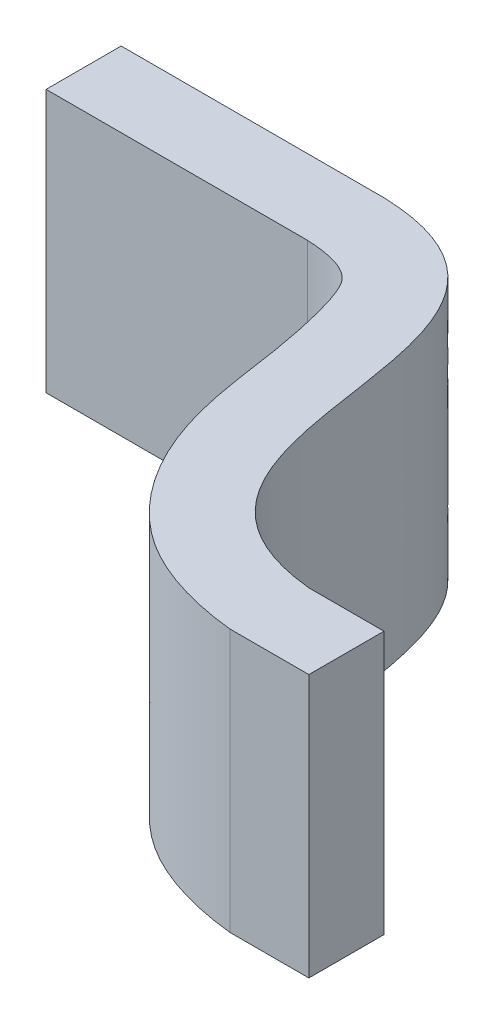
ISO-10303-21;
HEADER;
FILE_DESCRIPTION(('STEP AP214'),'2;1');
FILE_NAME('part.step','',(''),(''),'','','');
FILE_SCHEMA(('AUTOMOTIVE_DESIGN { 1 0 10303 214 1 1 1 1 }'));
ENDSEC;
DATA;
#1=APPLICATION_CONTEXT('core data for automotive mechanical design processes');
#2=APPLICATION_PROTOCOL_DEFINITION('international standard','automotive_design',2000,#1);
#3=PRODUCT_CONTEXT('',#1,'mechanical');
#4=PRODUCT('Part','Part','',(#3));
#5=PRODUCT_RELATED_PRODUCT_CATEGORY('part','',(#4));
#6=PRODUCT_DEFINITION_FORMATION('','',#4);
#7=PRODUCT_DEFINITION_CONTEXT('part definition',#1,'design');
#8=PRODUCT_DEFINITION('design','',#6,#7);
#9=PRODUCT_DEFINITION_SHAPE('','',#8);
#10=(LENGTH_UNIT() NAMED_UNIT(*) SI_UNIT(.MILLI.,.METRE.));
#11=(NAMED_UNIT(*) PLANE_ANGLE_UNIT() SI_UNIT($,.RADIAN.));
#12=(NAMED_UNIT(*) SI_UNIT($,.STERADIAN.) SOLID_ANGLE_UNIT());
#13=UNCERTAINTY_MEASURE_WITH_UNIT(LENGTH_MEASURE(1.E-05),#10,'distance_accuracy_value','');
#14=(GEOMETRIC_REPRESENTATION_CONTEXT(3) GLOBAL_UNCERTAINTY_ASSIGNED_CONTEXT((#13)) GLOBAL_UNIT_ASSIGNED_CONTEXT((#10,
#11,#12)) REPRESENTATION_CONTEXT('',''));
#15=CARTESIAN_POINT('',(0.,0.,0.));
#16=DIRECTION('',(0.,0.,1.));
#17=DIRECTION('',(1.,0.,0.));
#18=AXIS2_PLACEMENT_3D('',#15,#16,#17);
#19=CARTESIAN_POINT('',(0.381062000989914,0.523123965857835,1.2000000284124));
#20=DIRECTION('',(0.,-1.,-4.37113882867379E-08));
#21=DIRECTION('',(1.,0.,0.));
#22=AXIS2_PLACEMENT_3D('',#19,#20,#21);
#23=PLANE('',#22);
#24=CARTESIAN_POINT('',(-6.65393799901009,0.523123974600112,1.0000000284124));
#25=CARTESIAN_POINT('',(-6.67603378247592,0.523123974695338,0.997821538224357));
#26=CARTESIAN_POINT('',(-6.69814608533159,0.523123974839427,0.994525167165359));
#27=CARTESIAN_POINT('',(-6.74196000230599,0.523123975256913,0.984974174651607));
#28=CARTESIAN_POINT('',(-6.76365439120462,0.523123975531721,0.978687308291627));
#29=CARTESIAN_POINT('',(-6.80109928914061,0.523123976164227,0.964217236749239));
#30=CARTESIAN_POINT('',(-6.81711598043367,0.523123976490879,0.956744332526842));
#31=CARTESIAN_POINT('',(-6.84771104371223,0.523123977249195,0.939396085829372));
#32=CARTESIAN_POINT('',(-6.86229582381613,0.523123977680359,0.929532203397507));
#33=CARTESIAN_POINT('',(-6.88913715455262,0.523123978627769,0.907857995547797));
#34=CARTESIAN_POINT('',(-6.90145549336788,0.523123979140667,0.896124255535489));
#35=CARTESIAN_POINT('',(-6.92410333203055,0.523123980245379,0.870851377040501));
#36=CARTESIAN_POINT('',(-6.93442941955475,0.523123980837327,0.857309207032078));
#37=CARTESIAN_POINT('',(-6.96672356560466,0.523123982984108,0.808196568837444));
#38=CARTESIAN_POINT('',(-6.98364579428103,0.523123984681639,0.769361583704007));
#39=CARTESIAN_POINT('',(-7.00637915120374,0.523123987710567,0.700067795532776));
#40=CARTESIAN_POINT('',(-7.01393277364121,0.523123989022947,0.670044046614717));
#41=CARTESIAN_POINT('',(-7.02681062279047,0.523123991671226,0.609458466123205));
#42=CARTESIAN_POINT('',(-7.03213106678493,0.523123993007162,0.57889581220654));
#43=CARTESIAN_POINT('',(-7.04523612787774,0.523123996586,0.497021526470975));
#44=CARTESIAN_POINT('',(-7.0522656284455,0.523123998833501,0.445604703624302));
#45=CARTESIAN_POINT('',(-7.06583829430569,0.523124002183083,0.368975220682634));
#46=CARTESIAN_POINT('',(-7.0708647695897,0.52312400329558,0.343524254211093));
#47=CARTESIAN_POINT('',(-7.08290131021325,0.523124005498803,0.293120376456016));
#48=CARTESIAN_POINT('',(-7.08990811721131,0.523124006589561,0.2681667185286));
#49=CARTESIAN_POINT('',(-7.10754242158977,0.52312400877063,0.218269668597797));
#50=CARTESIAN_POINT('',(-7.11830963205075,0.523124009858999,0.193370728858566));
#51=CARTESIAN_POINT('',(-7.13814509854049,0.523124011397179,0.15818128887677));
#52=CARTESIAN_POINT('',(-7.14534233177561,0.523124011892748,0.146843995173803));
#53=CARTESIAN_POINT('',(-7.16105988122924,0.523124012841695,0.125134581067312));
#54=CARTESIAN_POINT('',(-7.16957893209141,0.523124013295114,0.114761552617267));
#55=CARTESIAN_POINT('',(-7.19091439754605,0.523124014285785,0.0920976354280375));
#56=CARTESIAN_POINT('',(-7.20423043199209,0.523124014802873,0.0802680737363762));
#57=CARTESIAN_POINT('',(-7.23280529274656,0.523124015723078,0.0592162571948251));
#58=CARTESIAN_POINT('',(-7.24806736713441,0.523124016126,0.0499984463761804));
#59=CARTESIAN_POINT('',(-7.28055680499388,0.523124016830915,0.0338718636663028));
#60=CARTESIAN_POINT('',(-7.29784019259106,0.523124017127877,0.0270781840761314));
#61=CARTESIAN_POINT('',(-7.33320890349723,0.523124017612247,0.0159971017986522));
#62=CARTESIAN_POINT('',(-7.35129600434054,0.523124017799397,0.0117155856600662));
#63=CARTESIAN_POINT('',(-7.383534227059,0.523124018050521,0.00597054024637853));
#64=CARTESIAN_POINT('',(-7.39761496113673,0.523124018133079,0.00408185602134198));
#65=CARTESIAN_POINT('',(-7.42577624030721,0.523124018253328,0.00133086562621749));
#66=CARTESIAN_POINT('',(-7.43985605615936,0.523124018291339,0.000461264208410071));
#67=CARTESIAN_POINT('',(-7.45393799901012,0.5231240183115,2.84124012060042E-08));
#68=B_SPLINE_CURVE_WITH_KNOTS('',3,(#24,#25,#26,#27,#28,#29,#30,#31,#32,#33,#34,#35,#36,#37,#38,
#39,#40,#41,#42,#43,#44,#45,#46,#47,#48,#49,#50,#51,#52,#53,#54,#55,#56,#57,#58,#59,#60,#61,#62,
#63,#64,#65,#66,#67),.UNSPECIFIED.,.F.,.F.,(4,2,2,2,2,2,2,2,2,2,2,2,2,2,2,2,2,2,2,2,2,4),(0.,
0.0667821137090824,0.134301214684021,0.187128508823984,0.239707439757734,0.290518731452926,
0.341416294675052,0.466712259088967,0.559563019654504,0.652570428897917,0.808245450373591,
0.886023921415191,0.963675157190782,1.0445878496654,1.08478909463836,1.12495209032637,
1.17807587168456,1.23128951042009,1.2867700351769,1.34238004906254,1.38496468867344,
1.42724258099922),.UNSPECIFIED.);
#69=CARTESIAN_POINT('',(-6.65393799901009,0.523123974600112,1.0000000284124));
#70=VERTEX_POINT('',#69);
#71=CARTESIAN_POINT('',(-7.45393799901009,0.523124018311501,2.84124023863797E-08));
#72=VERTEX_POINT('',#71);
#73=EDGE_CURVE('E11',#70,#72,#68,.T.);
#74=ORIENTED_EDGE('',*,*,#73,.F.);
#75=DIRECTION('',(-1.,0.,0.));
#76=VECTOR('',#75,1.);
#77=CARTESIAN_POINT('',(-6.45393799901009,0.523123974600112,1.0000000284124));
#78=LINE('',#77,#76);
#79=CARTESIAN_POINT('',(-6.45393799901009,0.523123974600112,1.0000000284124));
#80=VERTEX_POINT('',#79);
#81=EDGE_CURVE('E179',#80,#70,#78,.T.);
#82=ORIENTED_EDGE('',*,*,#81,.F.);
#83=DIRECTION('',(0.,4.37113883977602E-08,-0.999999999999999));
#84=VECTOR('',#83,1.);
#85=CARTESIAN_POINT('',(-6.45393799901009,0.523123965857835,1.2000000284124));
#86=LINE('',#85,#84);
#87=CARTESIAN_POINT('',(-6.45393799901009,0.523123965857835,1.2000000284124));
#88=VERTEX_POINT('',#87);
#89=EDGE_CURVE('E155',#88,#80,#86,.T.);
#90=ORIENTED_EDGE('',*,*,#89,.F.);
#91=DIRECTION('',(-1.,0.,0.));
#92=VECTOR('',#91,1.);
#93=CARTESIAN_POINT('',(-6.45393799901009,0.523123965857834,1.2000000284124));
#94=LINE('',#93,#92);
#95=CARTESIAN_POINT('',(-6.66373717585809,0.523123965857835,1.2000000284124));
#96=VERTEX_POINT('',#95);
#97=EDGE_CURVE('E148',#88,#96,#94,.T.);
#98=ORIENTED_EDGE('',*,*,#97,.T.);
#99=CARTESIAN_POINT('',(-6.66373717585809,0.523123965857835,1.2000000284124));
#100=CARTESIAN_POINT('',(-6.68237056257263,0.523123965938345,1.19815817509081));
#101=CARTESIAN_POINT('',(-6.70094738722954,0.523123966045734,1.19570139866285));
#102=CARTESIAN_POINT('',(-6.7379246105478,0.523123966316937,1.18949699907566));
#103=CARTESIAN_POINT('',(-6.75632454194431,0.523123966480872,1.1857466015809));
#104=CARTESIAN_POINT('',(-6.7929675339705,0.523123966869247,1.17686162524785));
#105=CARTESIAN_POINT('',(-6.81120769181061,0.523123967094217,1.17171489105383));
#106=CARTESIAN_POINT('',(-6.84718412122,0.523123967609347,1.15993009834338));
#107=CARTESIAN_POINT('',(-6.86492077676558,0.523123967899455,1.15329321263317));
#108=CARTESIAN_POINT('',(-6.90550702441668,0.523123968662994,1.13582549945528));
#109=CARTESIAN_POINT('',(-6.92808530032362,0.52312396916529,1.12433429434549));
#110=CARTESIAN_POINT('',(-6.97098069443299,0.523123970321421,1.09788507421921));
#111=CARTESIAN_POINT('',(-6.99130790145501,0.523123970974536,1.082943537511));
#112=CARTESIAN_POINT('',(-7.0279727762332,0.523123972347729,1.05152854045932));
#113=CARTESIAN_POINT('',(-7.04449924398274,0.523123973058332,1.03527184444206));
#114=CARTESIAN_POINT('',(-7.07543365798622,0.523123974565515,1.00079152577337));
#115=CARTESIAN_POINT('',(-7.08983601944683,0.523123975362312,0.982562928971803));
#116=CARTESIAN_POINT('',(-7.11809776879426,0.523123977121817,0.942310147448806));
#117=CARTESIAN_POINT('',(-7.13168204827002,0.523123978092944,0.920093360969633));
#118=CARTESIAN_POINT('',(-7.15606790009834,0.523123980097733,0.874229145825883));
#119=CARTESIAN_POINT('',(-7.16687319447414,0.523123981131308,0.850583683658809));
#120=CARTESIAN_POINT('',(-7.18657911699553,0.523123983331501,0.800249155192401));
#121=CARTESIAN_POINT('',(-7.19524763842126,0.523123984502043,0.773470263913924));
#122=CARTESIAN_POINT('',(-7.20996785968964,0.523123986874402,0.719197008038475));
#123=CARTESIAN_POINT('',(-7.21601637646933,0.523123988076255,0.691701815934891));
#124=CARTESIAN_POINT('',(-7.22445706680594,0.523123990042534,0.646718611183905));
#125=CARTESIAN_POINT('',(-7.22737168105378,0.523123990802987,0.629321471969463));
#126=CARTESIAN_POINT('',(-7.23282112861414,0.523123992326609,0.594465063705472));
#127=CARTESIAN_POINT('',(-7.23535587567411,0.523123993089778,0.577005781464265));
#128=CARTESIAN_POINT('',(-7.24044379035748,0.523123994615872,0.542092834268316));
#129=CARTESIAN_POINT('',(-7.24299695433449,0.523123995378796,0.524639168879595));
#130=CARTESIAN_POINT('',(-7.24854024165721,0.523123996901418,0.489805623245772));
#131=CARTESIAN_POINT('',(-7.25153024685593,0.523123997661117,0.472425724353722));
#132=CARTESIAN_POINT('',(-7.25940543221582,0.523123999514865,0.430016914878113));
#133=CARTESIAN_POINT('',(-7.26454124775707,0.523124000606984,0.405032186661608));
#134=CARTESIAN_POINT('',(-7.27335782095331,0.523124002233889,0.367812909831137));
#135=CARTESIAN_POINT('',(-7.27648289514104,0.523124002774419,0.355446989187105));
#136=CARTESIAN_POINT('',(-7.2832453862984,0.523124003849237,0.330858098256283));
#137=CARTESIAN_POINT('',(-7.28688251537886,0.523124004383529,0.31863505179595));
#138=CARTESIAN_POINT('',(-7.29335647517369,0.523124005225471,0.299373396061493));
#139=CARTESIAN_POINT('',(-7.29591902475202,0.523124005537099,0.292243982290243));
#140=CARTESIAN_POINT('',(-7.30149713681058,0.523124006152235,0.278171894198806));
#141=CARTESIAN_POINT('',(-7.30451201316556,0.523124006455754,0.27122895550911));
#142=CARTESIAN_POINT('',(-7.31077994191444,0.523124006990216,0.258999943257011));
#143=CARTESIAN_POINT('',(-7.31388605246379,0.523124007224206,0.253644766573164));
#144=CARTESIAN_POINT('',(-7.32081621454635,0.523124007632222,0.244316025576675));
#145=CARTESIAN_POINT('',(-7.32451240161513,0.523124007810065,0.240254004796937));
#146=CARTESIAN_POINT('',(-7.33396137139944,0.523124008166512,0.232075994627863));
#147=CARTESIAN_POINT('',(-7.33999881820825,0.523124008329575,0.228304080400057));
#148=CARTESIAN_POINT('',(-7.34921547868647,0.523124008558503,0.223113120130131));
#149=CARTESIAN_POINT('',(-7.35230200427145,0.523124008631944,0.221466188737755));
#150=CARTESIAN_POINT('',(-7.35859228869369,0.523124008763141,0.218417400174968));
#151=CARTESIAN_POINT('',(-7.36179572518167,0.523124008820938,0.21701492284427));
#152=CARTESIAN_POINT('',(-7.37091592035366,0.523124008970907,0.213465070828702));
#153=CARTESIAN_POINT('',(-7.37694933123149,0.523124009053497,0.211621727693836));
#154=CARTESIAN_POINT('',(-7.38671809463102,0.52312400916687,0.209137235761762));
#155=CARTESIAN_POINT('',(-7.3904112741511,0.523124009205184,0.208309721491275));
#156=CARTESIAN_POINT('',(-7.39782685498994,0.523124009272812,0.206799686569882));
#157=CARTESIAN_POINT('',(-7.40154925199958,0.523124009302127,0.206117144939589));
#158=CARTESIAN_POINT('',(-7.41391207862736,0.523124009392299,0.204032104639084));
#159=CARTESIAN_POINT('',(-7.42259188256675,0.523124009444025,0.202861138742713));
#160=CARTESIAN_POINT('',(-7.43564284724014,0.523124009504747,0.201476623687638));
#161=CARTESIAN_POINT('',(-7.4399954739608,0.52312400952217,0.201077249866301));
#162=CARTESIAN_POINT('',(-7.44871111958986,0.523124009550656,0.200424019159067));
#163=CARTESIAN_POINT('',(-7.45307413753338,0.523124009561719,0.200170149253582));
#164=CARTESIAN_POINT('',(-7.45744178074609,0.523124009569223,0.200000028412402));
#165=B_SPLINE_CURVE_WITH_KNOTS('',3,(#99,#100,#101,#102,#103,#104,#105,#106,#107,#108,#109,#110,
#111,#112,#113,#114,#115,#116,#117,#118,#119,#120,#121,#122,#123,#124,#125,#126,#127,#128,#129,
#130,#131,#132,#133,#134,#135,#136,#137,#138,#139,#140,#141,#142,#143,#144,#145,#146,#147,#148,
#149,#150,#151,#152,#153,#154,#155,#156,#157,#158,#159,#160,#161,#162,#163,#164),.UNSPECIFIED.,
.F.,.F.,(4,2,2,2,2,2,2,2,2,2,2,2,2,2,2,2,2,2,2,2,2,2,2,2,2,2,2,2,2,2,2,2,4),(0.,
0.0561681589095694,0.112457534383135,0.169253578612364,0.226005077906878,0.301715004036536,
0.377070566345993,0.446424912055148,0.515958475234814,0.593880428548582,0.671697467408242,
0.755964517163007,0.840333658382206,0.893247792631837,0.946173923407369,0.999089848164161,
1.05199148781442,1.12847716172405,1.16673541076623,1.20497223539783,1.22769072756633,
1.25037510056686,1.26886797593494,1.28517999290264,1.30634908955326,1.31685139211729,
1.32732665061524,1.34619861049413,1.3575513722042,1.36890248990408,1.39515927363249,
1.40827024085607,1.42138003473644),.UNSPECIFIED.);
#166=CARTESIAN_POINT('',(-7.45744178074609,0.523124009569223,0.200000028412402));
#167=VERTEX_POINT('',#166);
#168=EDGE_CURVE('E196',#96,#167,#165,.T.);
#169=ORIENTED_EDGE('',*,*,#168,.T.);
#170=DIRECTION('',(1.,0.,0.));
#171=VECTOR('',#170,1.);
#172=CARTESIAN_POINT('',(-8.15393799901009,0.523124009569222,0.200000028412401));
#173=LINE('',#172,#171);
#174=CARTESIAN_POINT('',(-8.15393799901009,0.523124009569223,0.200000028412402));
#175=VERTEX_POINT('',#174);
#176=EDGE_CURVE('E102',#175,#167,#173,.T.);
#177=ORIENTED_EDGE('',*,*,#176,.F.);
#178=DIRECTION('',(0.,4.37113883977602E-08,-0.999999999999999));
#179=VECTOR('',#178,1.);
#180=CARTESIAN_POINT('',(-8.15393799901009,0.523124009569223,0.200000028412402));
#181=LINE('',#180,#179);
#182=CARTESIAN_POINT('',(-8.15393799901009,0.523124018311501,2.84124023863797E-08));
#183=VERTEX_POINT('',#182);
#184=EDGE_CURVE('E90',#175,#183,#181,.T.);
#185=ORIENTED_EDGE('',*,*,#184,.T.);
#186=DIRECTION('',(-1.,0.,0.));
#187=VECTOR('',#186,1.);
#188=CARTESIAN_POINT('',(-7.45393799901009,0.523124018311501,2.84124023863797E-08));
#189=LINE('',#188,#187);
#190=EDGE_CURVE('E100',#72,#183,#189,.T.);
#191=ORIENTED_EDGE('',*,*,#190,.F.);
#192=EDGE_LOOP('',(#74,#82,#90,#98,#169,#177,#185,#191));
#193=FACE_BOUND('',#192,.T.);
#194=ADVANCED_FACE('F17',(#193),#23,.T.);
#195=CARTESIAN_POINT('',(0.381062000989914,1.22312396585783,1.20000005901037));
#196=DIRECTION('',(0.,-1.,-4.37113882867379E-08));
#197=DIRECTION('',(1.,0.,0.));
#198=AXIS2_PLACEMENT_3D('',#195,#196,#197);
#199=PLANE('',#198);
#200=DIRECTION('',(-1.,0.,0.));
#201=VECTOR('',#200,1.);
#202=CARTESIAN_POINT('',(-6.45393799901009,1.22312397460011,1.00000005901037));
#203=LINE('',#202,#201);
#204=CARTESIAN_POINT('',(-6.45393799901009,1.22312397460011,1.00000005901037));
#205=VERTEX_POINT('',#204);
#206=CARTESIAN_POINT('',(-6.65393799901009,1.22312397460011,1.00000005901037));
#207=VERTEX_POINT('',#206);
#208=EDGE_CURVE('E30',#205,#207,#203,.T.);
#209=ORIENTED_EDGE('',*,*,#208,.T.);
#210=CARTESIAN_POINT('',(-6.65393799901009,1.22312397460011,1.00000005901037));
#211=CARTESIAN_POINT('',(-6.67603378247592,1.22312397469533,0.99782156882233));
#212=CARTESIAN_POINT('',(-6.69814608533159,1.22312397483942,0.994525197763332));
#213=CARTESIAN_POINT('',(-6.74196000230599,1.22312397525691,0.984974205249579));
#214=CARTESIAN_POINT('',(-6.76365439120462,1.22312397553172,0.978687338889598));
#215=CARTESIAN_POINT('',(-6.80109928914061,1.22312397616422,0.96421726734721));
#216=CARTESIAN_POINT('',(-6.81711598043367,1.22312397649087,0.956744363124814));
#217=CARTESIAN_POINT('',(-6.84771104371223,1.22312397724919,0.939396116427344));
#218=CARTESIAN_POINT('',(-6.86229582381613,1.22312397768036,0.929532233995479));
#219=CARTESIAN_POINT('',(-6.88913715455262,1.22312397862777,0.907858026145769));
#220=CARTESIAN_POINT('',(-6.90145549336788,1.22312397914066,0.896124286133461));
#221=CARTESIAN_POINT('',(-6.92410333203055,1.22312398024537,0.870851407638473));
#222=CARTESIAN_POINT('',(-6.93442941955475,1.22312398083732,0.85730923763005));
#223=CARTESIAN_POINT('',(-6.96672356560466,1.22312398298411,0.808196599435415));
#224=CARTESIAN_POINT('',(-6.98364579428104,1.22312398468164,0.769361614301978));
#225=CARTESIAN_POINT('',(-7.00637915120374,1.22312398771056,0.700067826130747));
#226=CARTESIAN_POINT('',(-7.01393277364121,1.22312398902294,0.670044077212688));
#227=CARTESIAN_POINT('',(-7.02681062279047,1.22312399167122,0.609458496721176));
#228=CARTESIAN_POINT('',(-7.03213106678493,1.22312399300716,0.578895842804512));
#229=CARTESIAN_POINT('',(-7.04523612787774,1.223123996586,0.497021557068948));
#230=CARTESIAN_POINT('',(-7.05226562844549,1.2231239988335,0.445604734222274));
#231=CARTESIAN_POINT('',(-7.06583829430569,1.22312400218308,0.368975251280606));
#232=CARTESIAN_POINT('',(-7.0708647695897,1.22312400329557,0.343524284809065));
#233=CARTESIAN_POINT('',(-7.08290131021325,1.2231240054988,0.293120407053988));
#234=CARTESIAN_POINT('',(-7.08990811721131,1.22312400658956,0.268166749126572));
#235=CARTESIAN_POINT('',(-7.10754242158977,1.22312400877063,0.218269699195769));
#236=CARTESIAN_POINT('',(-7.11830963205075,1.22312400985899,0.193370759456537));
#237=CARTESIAN_POINT('',(-7.13814509854049,1.22312401139717,0.158181319474741));
#238=CARTESIAN_POINT('',(-7.14534233177561,1.22312401189274,0.146844025771775));
#239=CARTESIAN_POINT('',(-7.16105988122924,1.22312401284169,0.125134611665283));
#240=CARTESIAN_POINT('',(-7.16957893209141,1.22312401329511,0.114761583215238));
#241=CARTESIAN_POINT('',(-7.19091439754605,1.22312401428579,0.0920976660260085));
#242=CARTESIAN_POINT('',(-7.20423043199209,1.22312401480287,0.0802681043343472));
#243=CARTESIAN_POINT('',(-7.23280529274656,1.22312401572307,0.0592162877927965));
#244=CARTESIAN_POINT('',(-7.24806736713441,1.223124016126,0.0499984769741521));
#245=CARTESIAN_POINT('',(-7.28055680499388,1.22312401683092,0.0338718942642747));
#246=CARTESIAN_POINT('',(-7.29784019259106,1.22312401712787,0.0270782146741032));
#247=CARTESIAN_POINT('',(-7.33320890349723,1.22312401761224,0.015997132396624));
#248=CARTESIAN_POINT('',(-7.35129600434054,1.22312401779939,0.0117156162580381));
#249=CARTESIAN_POINT('',(-7.383534227059,1.22312401805052,0.0059705708443504));
#250=CARTESIAN_POINT('',(-7.39761496113673,1.22312401813307,0.00408188661931381));
#251=CARTESIAN_POINT('',(-7.42577624030721,1.22312401825332,0.00133089622418925));
#252=CARTESIAN_POINT('',(-7.43985605615936,1.22312401829133,0.000461294806381811));
#253=CARTESIAN_POINT('',(-7.45393799901012,1.2231240183115,5.90103729623118E-08));
#254=B_SPLINE_CURVE_WITH_KNOTS('',3,(#210,#211,#212,#213,#214,#215,#216,#217,#218,#219,#220,
#221,#222,#223,#224,#225,#226,#227,#228,#229,#230,#231,#232,#233,#234,#235,#236,#237,#238,#239,
#240,#241,#242,#243,#244,#245,#246,#247,#248,#249,#250,#251,#252,#253),.UNSPECIFIED.,.F.,.F.,(4,
2,2,2,2,2,2,2,2,2,2,2,2,2,2,2,2,2,2,2,2,4),(0.,0.0667821137090829,0.134301214684021,
0.187128508823984,0.239707439757733,0.290518731452925,0.341416294675052,0.466712259088968,
0.559563019654504,0.652570428897916,0.80824545037359,0.886023921415191,0.963675157190781,
1.0445878496654,1.08478909463836,1.12495209032637,1.17807587168456,1.23128951042009,
1.2867700351769,1.34238004906254,1.38496468867344,1.42724258099922),.UNSPECIFIED.);
#255=CARTESIAN_POINT('',(-7.45393799901009,1.2231240183115,5.90103741870962E-08));
#256=VERTEX_POINT('',#255);
#257=EDGE_CURVE('E158',#207,#256,#254,.T.);
#258=ORIENTED_EDGE('',*,*,#257,.T.);
#259=DIRECTION('',(-1.,0.,0.));
#260=VECTOR('',#259,1.);
#261=CARTESIAN_POINT('',(-7.45393799901009,1.2231240183115,5.90103741870962E-08));
#262=LINE('',#261,#260);
#263=CARTESIAN_POINT('',(-8.15393799901009,1.2231240183115,5.90103741870962E-08));
#264=VERTEX_POINT('',#263);
#265=EDGE_CURVE('E151',#256,#264,#262,.T.);
#266=ORIENTED_EDGE('',*,*,#265,.T.);
#267=DIRECTION('',(0.,4.37113878426487E-08,-0.999999999999999));
#268=VECTOR('',#267,1.);
#269=CARTESIAN_POINT('',(-8.15393799901009,1.22312400956922,0.200000059010374));
#270=LINE('',#269,#268);
#271=CARTESIAN_POINT('',(-8.15393799901009,1.22312400956922,0.200000059010374));
#272=VERTEX_POINT('',#271);
#273=EDGE_CURVE('E93',#272,#264,#270,.T.);
#274=ORIENTED_EDGE('',*,*,#273,.F.);
#275=DIRECTION('',(1.,0.,0.));
#276=VECTOR('',#275,1.);
#277=CARTESIAN_POINT('',(-8.15393799901009,1.22312400956922,0.200000059010372));
#278=LINE('',#277,#276);
#279=CARTESIAN_POINT('',(-7.45744178074609,1.22312400956922,0.200000059010374));
#280=VERTEX_POINT('',#279);
#281=EDGE_CURVE('E193',#272,#280,#278,.T.);
#282=ORIENTED_EDGE('',*,*,#281,.T.);
#283=CARTESIAN_POINT('',(-6.66373717585809,1.22312396585783,1.20000005901037));
#284=CARTESIAN_POINT('',(-6.68237056257263,1.22312396593834,1.19815820568879));
#285=CARTESIAN_POINT('',(-6.70094738722954,1.22312396604573,1.19570142926083));
#286=CARTESIAN_POINT('',(-6.7379246105478,1.22312396631693,1.18949702967363));
#287=CARTESIAN_POINT('',(-6.75632454194431,1.22312396648087,1.18574663217888));
#288=CARTESIAN_POINT('',(-6.7929675339705,1.22312396686924,1.17686165584582));
#289=CARTESIAN_POINT('',(-6.81120769181061,1.22312396709421,1.1717149216518));
#290=CARTESIAN_POINT('',(-6.84718412122,1.22312396760934,1.15993012894135));
#291=CARTESIAN_POINT('',(-6.86492077676558,1.22312396789945,1.15329324323114));
#292=CARTESIAN_POINT('',(-6.90550702441668,1.22312396866299,1.13582553005325));
#293=CARTESIAN_POINT('',(-6.92808530032362,1.22312396916528,1.12433432494346));
#294=CARTESIAN_POINT('',(-6.97098069443299,1.22312397032142,1.09788510481718));
#295=CARTESIAN_POINT('',(-6.99130790145501,1.22312397097454,1.08294356810897));
#296=CARTESIAN_POINT('',(-7.0279727762332,1.22312397234773,1.05152857105729));
#297=CARTESIAN_POINT('',(-7.04449924398274,1.22312397305833,1.03527187504003));
#298=CARTESIAN_POINT('',(-7.07543365798622,1.22312397456551,1.00079155637134));
#299=CARTESIAN_POINT('',(-7.08983601944683,1.22312397536231,0.982562959569775));
#300=CARTESIAN_POINT('',(-7.11809776879426,1.22312397712182,0.942310178046778));
#301=CARTESIAN_POINT('',(-7.13168204827002,1.22312397809294,0.920093391567605));
#302=CARTESIAN_POINT('',(-7.15606790009834,1.22312398009773,0.874229176423855));
#303=CARTESIAN_POINT('',(-7.16687319447414,1.22312398113131,0.850583714256781));
#304=CARTESIAN_POINT('',(-7.18657911699553,1.2231239833315,0.800249185790373));
#305=CARTESIAN_POINT('',(-7.19524763842126,1.22312398450204,0.773470294511896));
#306=CARTESIAN_POINT('',(-7.20996785968964,1.22312398687439,0.719197038636446));
#307=CARTESIAN_POINT('',(-7.21601637646933,1.22312398807625,0.691701846532862));
#308=CARTESIAN_POINT('',(-7.22445706680594,1.22312399004253,0.646718641781876));
#309=CARTESIAN_POINT('',(-7.22737168105378,1.22312399080298,0.629321502567434));
#310=CARTESIAN_POINT('',(-7.23282112861414,1.2231239923266,0.594465094303443));
#311=CARTESIAN_POINT('',(-7.23535587567411,1.22312399308977,0.577005812062236));
#312=CARTESIAN_POINT('',(-7.24044379035748,1.22312399461586,0.542092864866288));
#313=CARTESIAN_POINT('',(-7.24299695433449,1.22312399537879,0.524639199477567));
#314=CARTESIAN_POINT('',(-7.24854024165721,1.22312399690141,0.489805653843744));
#315=CARTESIAN_POINT('',(-7.25153024685593,1.22312399766111,0.472425754951694));
#316=CARTESIAN_POINT('',(-7.25940543221582,1.22312399951486,0.430016945476084));
#317=CARTESIAN_POINT('',(-7.26454124775706,1.22312400060698,0.40503221725958));
#318=CARTESIAN_POINT('',(-7.27335782095331,1.22312400223388,0.367812940429108));
#319=CARTESIAN_POINT('',(-7.27648289514104,1.22312400277441,0.355447019785077));
#320=CARTESIAN_POINT('',(-7.2832453862984,1.22312400384923,0.330858128854255));
#321=CARTESIAN_POINT('',(-7.28688251537886,1.22312400438353,0.318635082393922));
#322=CARTESIAN_POINT('',(-7.29335647517369,1.22312400522546,0.299373426659464));
#323=CARTESIAN_POINT('',(-7.29591902475202,1.22312400553708,0.292244012888214));
#324=CARTESIAN_POINT('',(-7.30149713681058,1.22312400615224,0.278171924796777));
#325=CARTESIAN_POINT('',(-7.30451201316556,1.22312400645579,0.271228986107082));
#326=CARTESIAN_POINT('',(-7.31077994191444,1.22312400699019,0.258999973854984));
#327=CARTESIAN_POINT('',(-7.31388605246379,1.2231240072241,0.253644797171136));
#328=CARTESIAN_POINT('',(-7.32081621454635,1.2231240076323,0.244316056174647));
#329=CARTESIAN_POINT('',(-7.32451240161513,1.22312400781037,0.240254035394908));
#330=CARTESIAN_POINT('',(-7.33396137139944,1.22312400816605,0.232076025225834));
#331=CARTESIAN_POINT('',(-7.33999881820825,1.22312400832774,0.228304110998029));
#332=CARTESIAN_POINT('',(-7.34921547868647,1.22312400855819,0.223113150728103));
#333=CARTESIAN_POINT('',(-7.35230200427145,1.22312400863272,0.221466219335727));
#334=CARTESIAN_POINT('',(-7.35859228869369,1.22312400876235,0.218417430772939));
#335=CARTESIAN_POINT('',(-7.36179572518167,1.2231240088175,0.217014953442241));
#336=CARTESIAN_POINT('',(-7.37091592035366,1.22312400896355,0.213465101426675));
#337=CARTESIAN_POINT('',(-7.37694933123149,1.22312400904766,0.211621758291808));
#338=CARTESIAN_POINT('',(-7.38671809463102,1.22312400916464,0.209137266359734));
#339=CARTESIAN_POINT('',(-7.3904112741511,1.22312400920456,0.208309752089247));
#340=CARTESIAN_POINT('',(-7.39782685498994,1.22312400927342,0.206799717167854));
#341=CARTESIAN_POINT('',(-7.40154925199958,1.22312400930234,0.206117175537561));
#342=CARTESIAN_POINT('',(-7.41391207862736,1.22312400939179,0.204032135237056));
#343=CARTESIAN_POINT('',(-7.42259188256675,1.22312400944392,0.202861169340685));
#344=CARTESIAN_POINT('',(-7.43564284724014,1.22312400950479,0.20147665428561));
#345=CARTESIAN_POINT('',(-7.4399954739608,1.22312400952219,0.201077280464273));
#346=CARTESIAN_POINT('',(-7.44871111958986,1.22312400955062,0.200424049757039));
#347=CARTESIAN_POINT('',(-7.45307413753338,1.22312400956166,0.200170179851554));
#348=CARTESIAN_POINT('',(-7.45744178074609,1.22312400956922,0.200000059010374));
#349=B_SPLINE_CURVE_WITH_KNOTS('',3,(#283,#284,#285,#286,#287,#288,#289,#290,#291,#292,#293,
#294,#295,#296,#297,#298,#299,#300,#301,#302,#303,#304,#305,#306,#307,#308,#309,#310,#311,#312,
#313,#314,#315,#316,#317,#318,#319,#320,#321,#322,#323,#324,#325,#326,#327,#328,#329,#330,#331,
#332,#333,#334,#335,#336,#337,#338,#339,#340,#341,#342,#343,#344,#345,#346,#347,#348),
.UNSPECIFIED.,.F.,.F.,(4,2,2,2,2,2,2,2,2,2,2,2,2,2,2,2,2,2,2,2,2,2,2,2,2,2,2,2,2,2,2,2,4),(0.,
0.0561681589095709,0.112457534383136,0.169253578612365,0.226005077906878,0.301715004036536,
0.377070566345994,0.446424912055148,0.515958475234814,0.593880428548581,0.671697467408241,
0.755964517163006,0.840333658382206,0.893247792631836,0.946173923407369,0.99908984816416,
1.05199148781441,1.12847716172405,1.16673541076623,1.20497223539783,1.22769072756633,
1.25037510056686,1.26886797593494,1.28517999290264,1.30634908955326,1.31685139211729,
1.32732665061524,1.34619861049413,1.3575513722042,1.36890248990408,1.39515927363249,
1.40827024085607,1.42138003473644),.UNSPECIFIED.);
#350=CARTESIAN_POINT('',(-6.66373717585809,1.22312396585783,1.20000005901037));
#351=VERTEX_POINT('',#350);
#352=EDGE_CURVE('E98',#351,#280,#349,.T.);
#353=ORIENTED_EDGE('',*,*,#352,.F.);
#354=DIRECTION('',(-1.,0.,0.));
#355=VECTOR('',#354,1.);
#356=CARTESIAN_POINT('',(-6.45393799901009,1.22312396585783,1.20000005901037));
#357=LINE('',#356,#355);
#358=CARTESIAN_POINT('',(-6.45393799901009,1.22312396585783,1.20000005901037));
#359=VERTEX_POINT('',#358);
#360=EDGE_CURVE('E164',#359,#351,#357,.T.);
#361=ORIENTED_EDGE('',*,*,#360,.F.);
#362=DIRECTION('',(0.,4.37113878426487E-08,-0.999999999999999));
#363=VECTOR('',#362,1.);
#364=CARTESIAN_POINT('',(-6.45393799901009,1.22312396585783,1.20000005901037));
#365=LINE('',#364,#363);
#366=EDGE_CURVE('E197',#359,#205,#365,.T.);
#367=ORIENTED_EDGE('',*,*,#366,.T.);
#368=EDGE_LOOP('',(#209,#258,#266,#274,#282,#353,#361,#367));
#369=FACE_BOUND('',#368,.T.);
#370=ADVANCED_FACE('F121',(#369),#199,.F.);
#371=CARTESIAN_POINT('',(0.381062000989914,-0.126876034142165,1.2));
#372=DIRECTION('',(0.,-4.37113882867379E-08,1.));
#373=DIRECTION('',(0.,-1.,-4.37113882867379E-08));
#374=AXIS2_PLACEMENT_3D('',#371,#372,#373);
#375=PLANE('',#374);
#376=ORIENTED_EDGE('',*,*,#360,.T.);
#377=DIRECTION('',(0.,-0.999999999999999,-4.37113881598552E-08));
#378=VECTOR('',#377,1.);
#379=CARTESIAN_POINT('',(-6.66373717585809,1.22312396585783,1.20000005901037));
#380=LINE('',#379,#378);
#381=EDGE_CURVE('E153',#351,#96,#380,.T.);
#382=ORIENTED_EDGE('',*,*,#381,.T.);
#383=ORIENTED_EDGE('',*,*,#97,.F.);
#384=DIRECTION('',(0.,0.999999999999999,4.37113881598552E-08));
#385=VECTOR('',#384,1.);
#386=CARTESIAN_POINT('',(-6.45393799901009,0.523123965857835,1.2000000284124));
#387=LINE('',#386,#385);
#388=EDGE_CURVE('E191',#88,#359,#387,.T.);
#389=ORIENTED_EDGE('',*,*,#388,.T.);
#390=EDGE_LOOP('',(#376,#382,#383,#389));
#391=FACE_BOUND('',#390,.T.);
#392=ADVANCED_FACE('F172',(#391),#375,.T.);
#393=CARTESIAN_POINT('',(-6.45393799901009,-0.126876034142165,1.2));
#394=DIRECTION('',(-1.,0.,0.));
#395=DIRECTION('',(0.,-1.,-4.37113882867379E-08));
#396=AXIS2_PLACEMENT_3D('',#393,#394,#395);
#397=PLANE('',#396);
#398=ORIENTED_EDGE('',*,*,#89,.T.);
#399=DIRECTION('',(0.,-0.999999999999999,-4.37113881598552E-08));
#400=VECTOR('',#399,1.);
#401=CARTESIAN_POINT('',(-6.45393799901009,1.22312397460011,1.00000005901037));
#402=LINE('',#401,#400);
#403=EDGE_CURVE('E140',#205,#80,#402,.T.);
#404=ORIENTED_EDGE('',*,*,#403,.F.);
#405=ORIENTED_EDGE('',*,*,#366,.F.);
#406=ORIENTED_EDGE('',*,*,#388,.F.);
#407=EDGE_LOOP('',(#398,#404,#405,#406));
#408=FACE_BOUND('',#407,.T.);
#409=ADVANCED_FACE('F209',(#408),#397,.F.);
#410=CARTESIAN_POINT('',(-8.15393799901009,-0.126876034142165,1.2));
#411=DIRECTION('',(-1.,0.,0.));
#412=DIRECTION('',(0.,-1.,-4.37113882867379E-08));
#413=AXIS2_PLACEMENT_3D('',#410,#411,#412);
#414=PLANE('',#413);
#415=DIRECTION('',(0.,-0.999999999999999,-4.37113881598552E-08));
#416=VECTOR('',#415,1.);
#417=CARTESIAN_POINT('',(-8.15393799901009,1.22312400956922,0.200000059010374));
#418=LINE('',#417,#416);
#419=EDGE_CURVE('E146',#272,#175,#418,.T.);
#420=ORIENTED_EDGE('',*,*,#419,.F.);
#421=ORIENTED_EDGE('',*,*,#273,.T.);
#422=DIRECTION('',(0.,0.999999999999999,4.37113882867379E-08));
#423=VECTOR('',#422,1.);
#424=CARTESIAN_POINT('',(-8.15393799901009,0.523124018311501,2.84124023863797E-08));
#425=LINE('',#424,#423);
#426=EDGE_CURVE('E87',#183,#264,#425,.T.);
#427=ORIENTED_EDGE('',*,*,#426,.F.);
#428=ORIENTED_EDGE('',*,*,#184,.F.);
#429=EDGE_LOOP('',(#420,#421,#427,#428));
#430=FACE_BOUND('',#429,.T.);
#431=ADVANCED_FACE('F89',(#430),#414,.T.);
#432=CARTESIAN_POINT('',(0.381062000989914,-0.126875981688499,0.));
#433=DIRECTION('',(0.,-4.37113882867379E-08,1.));
#434=DIRECTION('',(0.,-1.,-4.37113882867379E-08));
#435=AXIS2_PLACEMENT_3D('',#432,#433,#434);
#436=PLANE('',#435);
#437=ORIENTED_EDGE('',*,*,#265,.F.);
#438=DIRECTION('',(0.,-0.999999999999999,-4.37113882867379E-08));
#439=VECTOR('',#438,1.);
#440=CARTESIAN_POINT('',(-7.45393799901009,1.2231240183115,5.90103741870962E-08));
#441=LINE('',#440,#439);
#442=EDGE_CURVE('E97',#256,#72,#441,.T.);
#443=ORIENTED_EDGE('',*,*,#442,.T.);
#444=ORIENTED_EDGE('',*,*,#190,.T.);
#445=ORIENTED_EDGE('',*,*,#426,.T.);
#446=EDGE_LOOP('',(#437,#443,#444,#445));
#447=FACE_BOUND('',#446,.T.);
#448=ADVANCED_FACE('F105',(#447),#436,.F.);
#449=CARTESIAN_POINT('',(0.381062000989914,5.01775443609411,1.00000022487894));
#450=DIRECTION('',(0.,-4.37113882867379E-08,1.));
#451=DIRECTION('',(0.,-1.,-4.37113882867379E-08));
#452=AXIS2_PLACEMENT_3D('',#449,#450,#451);
#453=PLANE('',#452);
#454=ORIENTED_EDGE('',*,*,#81,.T.);
#455=DIRECTION('',(0.,-0.999999999999999,-4.37113881598552E-08));
#456=VECTOR('',#455,1.);
#457=CARTESIAN_POINT('',(-6.65393799901009,1.22312397460011,1.00000005901037));
#458=LINE('',#457,#456);
#459=EDGE_CURVE('E103',#207,#70,#458,.T.);
#460=ORIENTED_EDGE('',*,*,#459,.F.);
#461=ORIENTED_EDGE('',*,*,#208,.F.);
#462=ORIENTED_EDGE('',*,*,#403,.T.);
#463=EDGE_LOOP('',(#454,#460,#461,#462));
#464=FACE_BOUND('',#463,.T.);
#465=ADVANCED_FACE('F170',(#464),#453,.F.);
#466=CARTESIAN_POINT('',(-6.65393799901009,5.01775443609411,1.00000022487894));
#467=CARTESIAN_POINT('',(-7.29925539715409,5.01775443886489,0.93661226287194));
#468=CARTESIAN_POINT('',(-6.78984128963709,5.01775447886606,0.0214920441178097));
#469=CARTESIAN_POINT('',(-7.45393799901009,5.0177544798055,2.24878939694144E-07));
#470=B_SPLINE_CURVE_WITH_KNOTS('',3,(#466,#467,#468,#469),.UNSPECIFIED.,.F.,.F.,(4,4),(0.,1.),.UNSPECIFIED.);
#471=DIRECTION('',(0.,-0.999999999999999,-4.37113882867379E-08));
#472=VECTOR('',#471,1.);
#473=SURFACE_OF_LINEAR_EXTRUSION('',#470,#472);
#474=ORIENTED_EDGE('',*,*,#73,.T.);
#475=ORIENTED_EDGE('',*,*,#442,.F.);
#476=ORIENTED_EDGE('',*,*,#257,.F.);
#477=ORIENTED_EDGE('',*,*,#459,.T.);
#478=EDGE_LOOP('',(#474,#475,#476,#477));
#479=FACE_BOUND('',#478,.T.);
#480=ADVANCED_FACE('F166',(#479),#473,.F.);
#481=CARTESIAN_POINT('',(0.381062000989914,5.01775447106322,0.20000022487894));
#482=DIRECTION('',(0.,4.37113882867379E-08,-1.));
#483=DIRECTION('',(1.,0.,0.));
#484=AXIS2_PLACEMENT_3D('',#481,#482,#483);
#485=PLANE('',#484);
#486=ORIENTED_EDGE('',*,*,#176,.T.);
#487=DIRECTION('',(0.,-0.999999999999999,-4.37113881598552E-08));
#488=VECTOR('',#487,1.);
#489=CARTESIAN_POINT('',(-7.45744178074609,1.22312400956922,0.200000059010374));
#490=LINE('',#489,#488);
#491=EDGE_CURVE('E107',#280,#167,#490,.T.);
#492=ORIENTED_EDGE('',*,*,#491,.F.);
#493=ORIENTED_EDGE('',*,*,#281,.F.);
#494=ORIENTED_EDGE('',*,*,#419,.T.);
#495=EDGE_LOOP('',(#486,#492,#493,#494));
#496=FACE_BOUND('',#495,.T.);
#497=ADVANCED_FACE('F129',(#496),#485,.F.);
#498=CARTESIAN_POINT('',(-6.66373717585809,5.01775442735183,1.20000022487894));
#499=CARTESIAN_POINT('',(-6.76111157736509,5.01775442776993,1.19043537372094));
#500=CARTESIAN_POINT('',(-6.96545999269509,5.01775443018266,1.13523848292794));
#501=CARTESIAN_POINT('',(-7.20605275525609,5.01775444236442,0.85655227210794));
#502=CARTESIAN_POINT('',(-7.23834982502609,5.01775445822105,0.49379478761794));
#503=CARTESIAN_POINT('',(-7.29819788966409,5.01775446848464,0.25899132482694));
#504=CARTESIAN_POINT('',(-7.33605449676609,5.0177544697967,0.22897490490494));
#505=CARTESIAN_POINT('',(-7.37899552435409,5.01775447070118,0.20828275194794));
#506=CARTESIAN_POINT('',(-7.43390389640609,5.01775447102387,0.20090043049794));
#507=CARTESIAN_POINT('',(-7.45744178074609,5.01775447106322,0.20000022487894));
#508=B_SPLINE_CURVE_WITH_KNOTS('',3,(#498,#499,#500,#501,#502,#503,#504,#505,#506,#507),
.UNSPECIFIED.,.F.,.F.,(4,1,1,1,1,1,1,4),(-0.005037439357121,0.120331553469,0.245700546295,
0.496438531947,0.747176517599,0.872545510425,0.935230006838,0.997914503251),.UNSPECIFIED.);
#509=DIRECTION('',(0.,-0.999999999999999,-4.37113882867379E-08));
#510=VECTOR('',#509,1.);
#511=SURFACE_OF_LINEAR_EXTRUSION('',#508,#510);
#512=ORIENTED_EDGE('',*,*,#381,.F.);
#513=ORIENTED_EDGE('',*,*,#352,.T.);
#514=ORIENTED_EDGE('',*,*,#491,.T.);
#515=ORIENTED_EDGE('',*,*,#168,.F.);
#516=EDGE_LOOP('',(#512,#513,#514,#515));
#517=FACE_BOUND('',#516,.T.);
#518=ADVANCED_FACE('F123',(#517),#511,.T.);
#519=CLOSED_SHELL('',(#194,#370,#392,#409,#431,#448,#465,#480,#497,#518));
#520=MANIFOLD_SOLID_BREP('B1',#519);
#521=ADVANCED_BREP_SHAPE_REPRESENTATION('',(#18,#520),#14);
#522=SHAPE_DEFINITION_REPRESENTATION(#9,#521);
ENDSEC;
END-ISO-10303-21;
